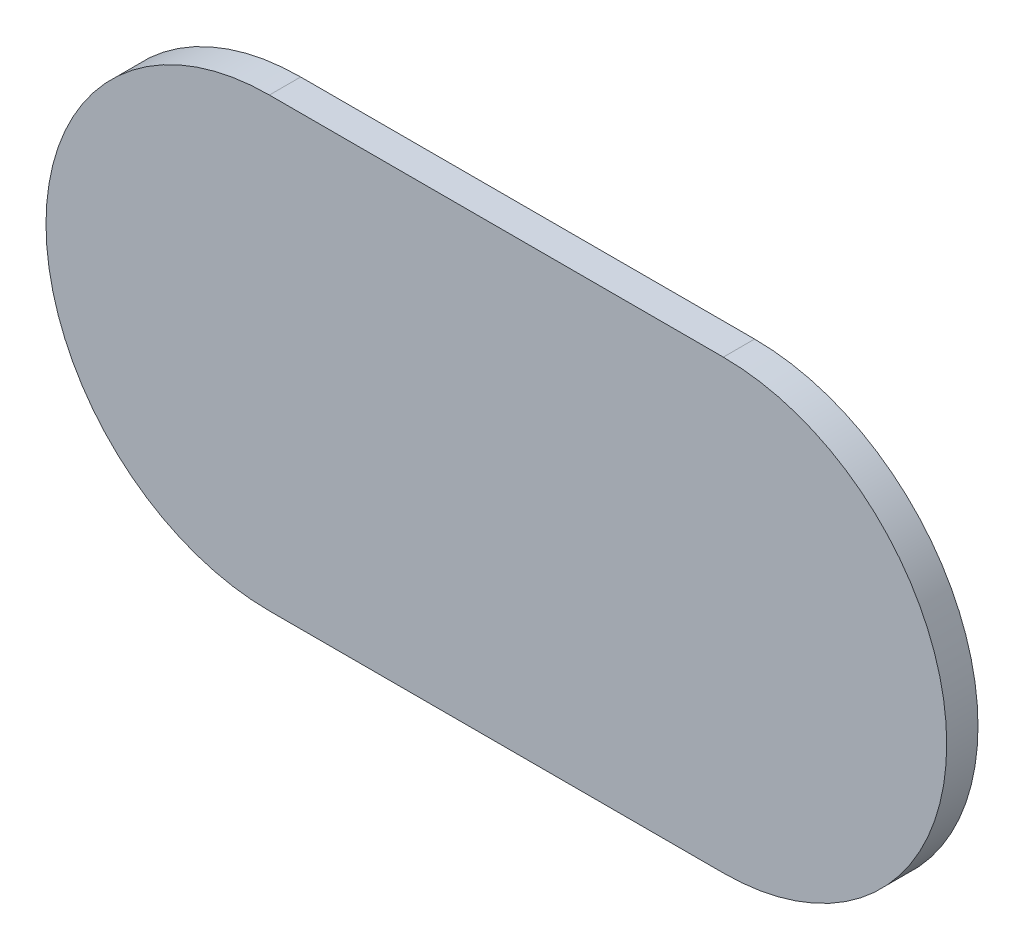
ISO-10303-21;
HEADER;
FILE_DESCRIPTION(('STEP AP214'),'2;1');
FILE_NAME('part.step','',(''),(''),'','','');
FILE_SCHEMA(('AUTOMOTIVE_DESIGN { 1 0 10303 214 1 1 1 1 }'));
ENDSEC;
DATA;
#1=APPLICATION_CONTEXT('core data for automotive mechanical design processes');
#2=APPLICATION_PROTOCOL_DEFINITION('international standard','automotive_design',2000,#1);
#3=PRODUCT_CONTEXT('',#1,'mechanical');
#4=PRODUCT('Part','Part','',(#3));
#5=PRODUCT_RELATED_PRODUCT_CATEGORY('part','',(#4));
#6=PRODUCT_DEFINITION_FORMATION('','',#4);
#7=PRODUCT_DEFINITION_CONTEXT('part definition',#1,'design');
#8=PRODUCT_DEFINITION('design','',#6,#7);
#9=PRODUCT_DEFINITION_SHAPE('','',#8);
#10=(LENGTH_UNIT() NAMED_UNIT(*) SI_UNIT(.MILLI.,.METRE.));
#11=(NAMED_UNIT(*) PLANE_ANGLE_UNIT() SI_UNIT($,.RADIAN.));
#12=(NAMED_UNIT(*) SI_UNIT($,.STERADIAN.) SOLID_ANGLE_UNIT());
#13=UNCERTAINTY_MEASURE_WITH_UNIT(LENGTH_MEASURE(1.E-05),#10,'distance_accuracy_value','');
#14=(GEOMETRIC_REPRESENTATION_CONTEXT(3) GLOBAL_UNCERTAINTY_ASSIGNED_CONTEXT((#13)) GLOBAL_UNIT_ASSIGNED_CONTEXT((#10,
#11,#12)) REPRESENTATION_CONTEXT('',''));
#15=CARTESIAN_POINT('',(0.,0.,0.));
#16=DIRECTION('',(0.,0.,1.));
#17=DIRECTION('',(1.,0.,0.));
#18=AXIS2_PLACEMENT_3D('',#15,#16,#17);
#19=CARTESIAN_POINT('',(168.91,-144.784,0.));
#20=DIRECTION('',(0.,0.,1.));
#21=DIRECTION('',(1.,0.,0.));
#22=AXIS2_PLACEMENT_3D('',#19,#20,#21);
#23=PLANE('',#22);
#24=DIRECTION('',(-1.,0.,0.));
#25=VECTOR('',#24,1.);
#26=CARTESIAN_POINT('',(168.91,-144.784,0.));
#27=LINE('',#26,#25);
#28=CARTESIAN_POINT('',(168.91,-144.784,0.));
#29=VERTEX_POINT('',#28);
#30=CARTESIAN_POINT('',(168.402,-144.784,0.));
#31=VERTEX_POINT('',#30);
#32=EDGE_CURVE('E76',#29,#31,#27,.T.);
#33=ORIENTED_EDGE('',*,*,#32,.T.);
#34=CARTESIAN_POINT('',(168.402,-145.034,0.));
#35=DIRECTION('',(0.,0.,1.));
#36=DIRECTION('',(0.,1.,0.));
#37=AXIS2_PLACEMENT_3D('',#34,#35,#36);
#38=CIRCLE('',#37,0.25);
#39=CARTESIAN_POINT('',(168.402,-145.284,0.));
#40=VERTEX_POINT('',#39);
#41=EDGE_CURVE('E74',#31,#40,#38,.T.);
#42=ORIENTED_EDGE('',*,*,#41,.T.);
#43=DIRECTION('',(1.,0.,0.));
#44=VECTOR('',#43,1.);
#45=CARTESIAN_POINT('',(168.402,-145.284,0.));
#46=LINE('',#45,#44);
#47=CARTESIAN_POINT('',(168.91,-145.284,0.));
#48=VERTEX_POINT('',#47);
#49=EDGE_CURVE('E62',#40,#48,#46,.T.);
#50=ORIENTED_EDGE('',*,*,#49,.T.);
#51=CARTESIAN_POINT('',(168.91,-145.034,0.));
#52=DIRECTION('',(0.,0.,1.));
#53=DIRECTION('',(0.,-1.,0.));
#54=AXIS2_PLACEMENT_3D('',#51,#52,#53);
#55=CIRCLE('',#54,0.25);
#56=EDGE_CURVE('E11',#48,#29,#55,.T.);
#57=ORIENTED_EDGE('',*,*,#56,.T.);
#58=EDGE_LOOP('',(#33,#42,#50,#57));
#59=FACE_BOUND('',#58,.T.);
#60=ADVANCED_FACE('F17',(#59),#23,.T.);
#61=CARTESIAN_POINT('',(168.91,-144.784,-0.035));
#62=DIRECTION('',(0.,0.,1.));
#63=DIRECTION('',(1.,0.,0.));
#64=AXIS2_PLACEMENT_3D('',#61,#62,#63);
#65=PLANE('',#64);
#66=CARTESIAN_POINT('',(168.91,-145.034,-0.035));
#67=DIRECTION('',(0.,0.,1.));
#68=DIRECTION('',(0.,-1.,0.));
#69=AXIS2_PLACEMENT_3D('',#66,#67,#68);
#70=CIRCLE('',#69,0.25);
#71=CARTESIAN_POINT('',(168.91,-145.284,-0.035));
#72=VERTEX_POINT('',#71);
#73=CARTESIAN_POINT('',(168.91,-144.784,-0.035));
#74=VERTEX_POINT('',#73);
#75=EDGE_CURVE('E26',#72,#74,#70,.T.);
#76=ORIENTED_EDGE('',*,*,#75,.F.);
#77=DIRECTION('',(1.,0.,0.));
#78=VECTOR('',#77,1.);
#79=CARTESIAN_POINT('',(168.402,-145.284,-0.035));
#80=LINE('',#79,#78);
#81=CARTESIAN_POINT('',(168.402,-145.284,-0.035));
#82=VERTEX_POINT('',#81);
#83=EDGE_CURVE('E55',#82,#72,#80,.T.);
#84=ORIENTED_EDGE('',*,*,#83,.F.);
#85=CARTESIAN_POINT('',(168.402,-145.034,-0.035));
#86=DIRECTION('',(0.,0.,1.));
#87=DIRECTION('',(0.,1.,0.));
#88=AXIS2_PLACEMENT_3D('',#85,#86,#87);
#89=CIRCLE('',#88,0.25);
#90=CARTESIAN_POINT('',(168.402,-144.784,-0.035));
#91=VERTEX_POINT('',#90);
#92=EDGE_CURVE('E83',#91,#82,#89,.T.);
#93=ORIENTED_EDGE('',*,*,#92,.F.);
#94=DIRECTION('',(-1.,0.,0.));
#95=VECTOR('',#94,1.);
#96=CARTESIAN_POINT('',(168.91,-144.784,-0.035));
#97=LINE('',#96,#95);
#98=EDGE_CURVE('E120',#74,#91,#97,.T.);
#99=ORIENTED_EDGE('',*,*,#98,.F.);
#100=EDGE_LOOP('',(#76,#84,#93,#99));
#101=FACE_BOUND('',#100,.T.);
#102=ADVANCED_FACE('F173',(#101),#65,.F.);
#103=CARTESIAN_POINT('',(168.91,-145.034,-0.035));
#104=DIRECTION('',(0.,0.,-1.));
#105=DIRECTION('',(0.,-1.,0.));
#106=AXIS2_PLACEMENT_3D('',#103,#104,#105);
#107=CYLINDRICAL_SURFACE('',#106,0.25);
#108=ORIENTED_EDGE('',*,*,#75,.T.);
#109=DIRECTION('',(0.,0.,1.));
#110=VECTOR('',#109,1.);
#111=CARTESIAN_POINT('',(168.91,-144.784,-0.035));
#112=LINE('',#111,#110);
#113=EDGE_CURVE('E90',#74,#29,#112,.T.);
#114=ORIENTED_EDGE('',*,*,#113,.T.);
#115=ORIENTED_EDGE('',*,*,#56,.F.);
#116=DIRECTION('',(0.,0.,1.));
#117=VECTOR('',#116,1.);
#118=CARTESIAN_POINT('',(168.91,-145.284,-0.035));
#119=LINE('',#118,#117);
#120=EDGE_CURVE('E68',#72,#48,#119,.T.);
#121=ORIENTED_EDGE('',*,*,#120,.F.);
#122=EDGE_LOOP('',(#108,#114,#115,#121));
#123=FACE_BOUND('',#122,.T.);
#124=ADVANCED_FACE('F164',(#123),#107,.T.);
#125=CARTESIAN_POINT('',(168.402,-145.284,-0.035));
#126=DIRECTION('',(0.,1.,0.));
#127=DIRECTION('',(1.,0.,0.));
#128=AXIS2_PLACEMENT_3D('',#125,#126,#127);
#129=PLANE('',#128);
#130=ORIENTED_EDGE('',*,*,#83,.T.);
#131=ORIENTED_EDGE('',*,*,#120,.T.);
#132=ORIENTED_EDGE('',*,*,#49,.F.);
#133=DIRECTION('',(0.,0.,1.));
#134=VECTOR('',#133,1.);
#135=CARTESIAN_POINT('',(168.402,-145.284,-0.035));
#136=LINE('',#135,#134);
#137=EDGE_CURVE('E66',#82,#40,#136,.T.);
#138=ORIENTED_EDGE('',*,*,#137,.F.);
#139=EDGE_LOOP('',(#130,#131,#132,#138));
#140=FACE_BOUND('',#139,.T.);
#141=ADVANCED_FACE('F64',(#140),#129,.F.);
#142=CARTESIAN_POINT('',(168.402,-145.034,-0.035));
#143=DIRECTION('',(0.,0.,-1.));
#144=DIRECTION('',(0.,1.,0.));
#145=AXIS2_PLACEMENT_3D('',#142,#143,#144);
#146=CYLINDRICAL_SURFACE('',#145,0.25);
#147=ORIENTED_EDGE('',*,*,#92,.T.);
#148=ORIENTED_EDGE('',*,*,#137,.T.);
#149=ORIENTED_EDGE('',*,*,#41,.F.);
#150=DIRECTION('',(0.,0.,1.));
#151=VECTOR('',#150,1.);
#152=CARTESIAN_POINT('',(168.402,-144.784,-0.035));
#153=LINE('',#152,#151);
#154=EDGE_CURVE('E94',#91,#31,#153,.T.);
#155=ORIENTED_EDGE('',*,*,#154,.F.);
#156=EDGE_LOOP('',(#147,#148,#149,#155));
#157=FACE_BOUND('',#156,.T.);
#158=ADVANCED_FACE('F82',(#157),#146,.T.);
#159=CARTESIAN_POINT('',(168.91,-144.784,-0.035));
#160=DIRECTION('',(0.,-1.,0.));
#161=DIRECTION('',(0.,0.,-1.));
#162=AXIS2_PLACEMENT_3D('',#159,#160,#161);
#163=PLANE('',#162);
#164=ORIENTED_EDGE('',*,*,#98,.T.);
#165=ORIENTED_EDGE('',*,*,#154,.T.);
#166=ORIENTED_EDGE('',*,*,#32,.F.);
#167=ORIENTED_EDGE('',*,*,#113,.F.);
#168=EDGE_LOOP('',(#164,#165,#166,#167));
#169=FACE_BOUND('',#168,.T.);
#170=ADVANCED_FACE('F141',(#169),#163,.F.);
#171=CLOSED_SHELL('',(#60,#102,#124,#141,#158,#170));
#172=MANIFOLD_SOLID_BREP('B1',#171);
#173=ADVANCED_BREP_SHAPE_REPRESENTATION('',(#18,#172),#14);
#174=SHAPE_DEFINITION_REPRESENTATION(#9,#173);
ENDSEC;
END-ISO-10303-21;
